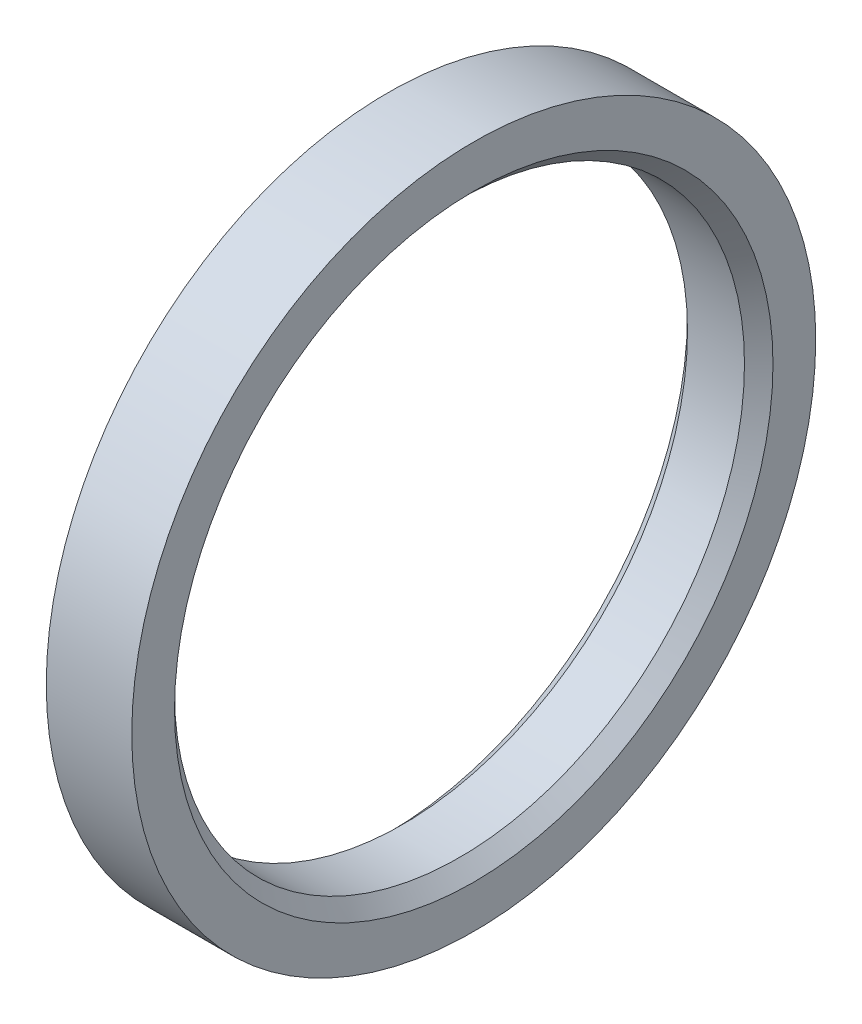
ISO-10303-21;
HEADER;
FILE_DESCRIPTION(('STEP AP214'),'2;1');
FILE_NAME('part.step','',(''),(''),'','','');
FILE_SCHEMA(('AUTOMOTIVE_DESIGN { 1 0 10303 214 1 1 1 1 }'));
ENDSEC;
DATA;
#1=APPLICATION_CONTEXT('core data for automotive mechanical design processes');
#2=APPLICATION_PROTOCOL_DEFINITION('international standard','automotive_design',2000,#1);
#3=PRODUCT_CONTEXT('',#1,'mechanical');
#4=PRODUCT('Part','Part','',(#3));
#5=PRODUCT_RELATED_PRODUCT_CATEGORY('part','',(#4));
#6=PRODUCT_DEFINITION_FORMATION('','',#4);
#7=PRODUCT_DEFINITION_CONTEXT('part definition',#1,'design');
#8=PRODUCT_DEFINITION('design','',#6,#7);
#9=PRODUCT_DEFINITION_SHAPE('','',#8);
#10=(LENGTH_UNIT() NAMED_UNIT(*) SI_UNIT(.MILLI.,.METRE.));
#11=(NAMED_UNIT(*) PLANE_ANGLE_UNIT() SI_UNIT($,.RADIAN.));
#12=(NAMED_UNIT(*) SI_UNIT($,.STERADIAN.) SOLID_ANGLE_UNIT());
#13=UNCERTAINTY_MEASURE_WITH_UNIT(LENGTH_MEASURE(1.E-05),#10,'distance_accuracy_value','');
#14=(GEOMETRIC_REPRESENTATION_CONTEXT(3) GLOBAL_UNCERTAINTY_ASSIGNED_CONTEXT((#13)) GLOBAL_UNIT_ASSIGNED_CONTEXT((#10,
#11,#12)) REPRESENTATION_CONTEXT('',''));
#15=CARTESIAN_POINT('',(0.,0.,0.));
#16=DIRECTION('',(0.,0.,1.));
#17=DIRECTION('',(1.,0.,0.));
#18=AXIS2_PLACEMENT_3D('',#15,#16,#17);
#19=CARTESIAN_POINT('',(0.,10.,0.));
#20=DIRECTION('',(-1.,0.,0.));
#21=DIRECTION('',(0.,0.,1.));
#22=AXIS2_PLACEMENT_3D('',#19,#20,#21);
#23=PLANE('',#22);
#24=CARTESIAN_POINT('',(0.,0.,0.));
#25=DIRECTION('',(-1.,0.,0.));
#26=DIRECTION('',(0.,0.,1.));
#27=AXIS2_PLACEMENT_3D('',#24,#25,#26);
#28=CIRCLE('',#27,10.5);
#29=CARTESIAN_POINT('',(0.,0.,10.5));
#30=VERTEX_POINT('',#29);
#31=EDGE_CURVE('E49',#30,#30,#28,.F.);
#32=ORIENTED_EDGE('',*,*,#31,.T.);
#33=EDGE_LOOP('',(#32));
#34=FACE_BOUND('',#33,.T.);
#35=CARTESIAN_POINT('',(0.,0.,0.));
#36=DIRECTION('',(1.,0.,0.));
#37=DIRECTION('',(0.,0.,-1.));
#38=AXIS2_PLACEMENT_3D('',#35,#36,#37);
#39=CIRCLE('',#38,12.);
#40=CARTESIAN_POINT('',(0.,0.,-12.));
#41=VERTEX_POINT('',#40);
#42=EDGE_CURVE('E54',#41,#41,#39,.T.);
#43=ORIENTED_EDGE('',*,*,#42,.F.);
#44=EDGE_LOOP('',(#43));
#45=FACE_BOUND('',#44,.T.);
#46=ADVANCED_FACE('F34',(#34,#45),#23,.T.);
#47=CARTESIAN_POINT('',(0.,0.,0.));
#48=DIRECTION('',(1.,0.,0.));
#49=DIRECTION('',(0.,0.,-1.));
#50=AXIS2_PLACEMENT_3D('',#47,#48,#49);
#51=CYLINDRICAL_SURFACE('',#50,12.);
#52=ORIENTED_EDGE('',*,*,#42,.T.);
#53=EDGE_LOOP('',(#52));
#54=FACE_BOUND('',#53,.T.);
#55=CARTESIAN_POINT('',(3.,0.,0.));
#56=DIRECTION('',(1.,0.,0.));
#57=DIRECTION('',(0.,0.,-1.));
#58=AXIS2_PLACEMENT_3D('',#55,#56,#57);
#59=CIRCLE('',#58,12.);
#60=CARTESIAN_POINT('',(3.,0.,-12.));
#61=VERTEX_POINT('',#60);
#62=EDGE_CURVE('E57',#61,#61,#59,.T.);
#63=ORIENTED_EDGE('',*,*,#62,.F.);
#64=EDGE_LOOP('',(#63));
#65=FACE_BOUND('',#64,.T.);
#66=ADVANCED_FACE('F63',(#54,#65),#51,.T.);
#67=CARTESIAN_POINT('',(3.,10.,0.));
#68=DIRECTION('',(1.,0.,0.));
#69=DIRECTION('',(0.,0.,-1.));
#70=AXIS2_PLACEMENT_3D('',#67,#68,#69);
#71=PLANE('',#70);
#72=CARTESIAN_POINT('',(3.,0.,0.));
#73=DIRECTION('',(1.,0.,0.));
#74=DIRECTION('',(0.,0.,-1.));
#75=AXIS2_PLACEMENT_3D('',#72,#73,#74);
#76=CIRCLE('',#75,10.5);
#77=CARTESIAN_POINT('',(3.,0.,-10.5));
#78=VERTEX_POINT('',#77);
#79=EDGE_CURVE('E10',#78,#78,#76,.F.);
#80=ORIENTED_EDGE('',*,*,#79,.T.);
#81=EDGE_LOOP('',(#80));
#82=FACE_BOUND('',#81,.T.);
#83=ORIENTED_EDGE('',*,*,#62,.T.);
#84=EDGE_LOOP('',(#83));
#85=FACE_BOUND('',#84,.T.);
#86=ADVANCED_FACE('F61',(#82,#85),#71,.T.);
#87=CARTESIAN_POINT('',(0.,0.,0.));
#88=DIRECTION('',(1.,0.,0.));
#89=DIRECTION('',(0.,0.,-1.));
#90=AXIS2_PLACEMENT_3D('',#87,#88,#89);
#91=CYLINDRICAL_SURFACE('',#90,10.);
#92=CARTESIAN_POINT('',(0.500000000000006,0.,0.));
#93=DIRECTION('',(-1.,0.,0.));
#94=DIRECTION('',(0.,0.,1.));
#95=AXIS2_PLACEMENT_3D('',#92,#93,#94);
#96=CIRCLE('',#95,10.);
#97=CARTESIAN_POINT('',(0.500000000000006,0.,10.));
#98=VERTEX_POINT('',#97);
#99=EDGE_CURVE('E41',#98,#98,#96,.T.);
#100=ORIENTED_EDGE('',*,*,#99,.T.);
#101=EDGE_LOOP('',(#100));
#102=FACE_BOUND('',#101,.T.);
#103=CARTESIAN_POINT('',(2.50000000000001,0.,0.));
#104=DIRECTION('',(1.,0.,0.));
#105=DIRECTION('',(0.,0.,-1.));
#106=AXIS2_PLACEMENT_3D('',#103,#104,#105);
#107=CIRCLE('',#106,10.);
#108=CARTESIAN_POINT('',(2.50000000000001,0.,-10.));
#109=VERTEX_POINT('',#108);
#110=EDGE_CURVE('E45',#109,#109,#107,.T.);
#111=ORIENTED_EDGE('',*,*,#110,.T.);
#112=EDGE_LOOP('',(#111));
#113=FACE_BOUND('',#112,.T.);
#114=ADVANCED_FACE('F71',(#102,#113),#91,.F.);
#115=CARTESIAN_POINT('',(0.,0.,0.));
#116=DIRECTION('',(-1.,0.,0.));
#117=DIRECTION('',(0.,0.,1.));
#118=AXIS2_PLACEMENT_3D('',#115,#116,#117);
#119=CONICAL_SURFACE('',#118,10.5,0.785398163397448);
#120=ORIENTED_EDGE('',*,*,#99,.F.);
#121=EDGE_LOOP('',(#120));
#122=FACE_BOUND('',#121,.T.);
#123=ORIENTED_EDGE('',*,*,#31,.F.);
#124=EDGE_LOOP('',(#123));
#125=FACE_BOUND('',#124,.T.);
#126=ADVANCED_FACE('F76',(#122,#125),#119,.F.);
#127=CARTESIAN_POINT('',(2.50000000000001,0.,0.));
#128=DIRECTION('',(1.,0.,0.));
#129=DIRECTION('',(0.,0.,-1.));
#130=AXIS2_PLACEMENT_3D('',#127,#128,#129);
#131=CONICAL_SURFACE('',#130,10.,0.785398163397448);
#132=ORIENTED_EDGE('',*,*,#79,.F.);
#133=EDGE_LOOP('',(#132));
#134=FACE_BOUND('',#133,.T.);
#135=ORIENTED_EDGE('',*,*,#110,.F.);
#136=EDGE_LOOP('',(#135));
#137=FACE_BOUND('',#136,.T.);
#138=ADVANCED_FACE('F36',(#134,#137),#131,.F.);
#139=CLOSED_SHELL('',(#46,#66,#86,#114,#126,#138));
#140=MANIFOLD_SOLID_BREP('B2',#139);
#141=ADVANCED_BREP_SHAPE_REPRESENTATION('',(#18,#140),#14);
#142=SHAPE_DEFINITION_REPRESENTATION(#9,#141);
ENDSEC;
END-ISO-10303-21;
